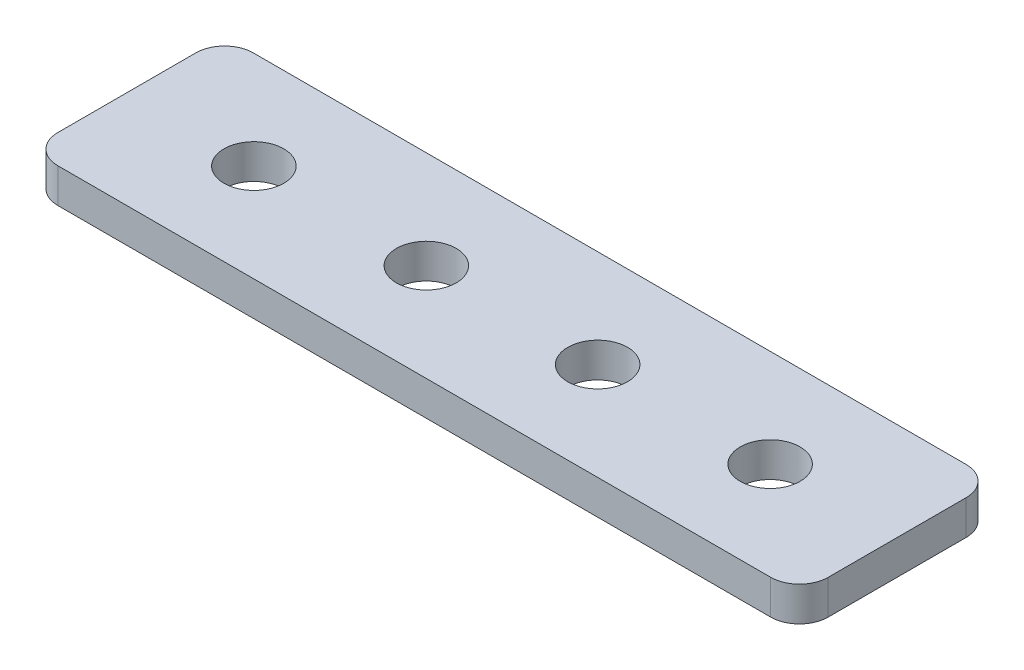
ISO-10303-21;
HEADER;
FILE_DESCRIPTION(('STEP AP214'),'2;1');
FILE_NAME('part.step','',(''),(''),'','','');
FILE_SCHEMA(('AUTOMOTIVE_DESIGN { 1 0 10303 214 1 1 1 1 }'));
ENDSEC;
DATA;
#1=APPLICATION_CONTEXT('core data for automotive mechanical design processes');
#2=APPLICATION_PROTOCOL_DEFINITION('international standard','automotive_design',2000,#1);
#3=PRODUCT_CONTEXT('',#1,'mechanical');
#4=PRODUCT('Part','Part','',(#3));
#5=PRODUCT_RELATED_PRODUCT_CATEGORY('part','',(#4));
#6=PRODUCT_DEFINITION_FORMATION('','',#4);
#7=PRODUCT_DEFINITION_CONTEXT('part definition',#1,'design');
#8=PRODUCT_DEFINITION('design','',#6,#7);
#9=PRODUCT_DEFINITION_SHAPE('','',#8);
#10=(LENGTH_UNIT() NAMED_UNIT(*) SI_UNIT(.MILLI.,.METRE.));
#11=(NAMED_UNIT(*) PLANE_ANGLE_UNIT() SI_UNIT($,.RADIAN.));
#12=(NAMED_UNIT(*) SI_UNIT($,.STERADIAN.) SOLID_ANGLE_UNIT());
#13=UNCERTAINTY_MEASURE_WITH_UNIT(LENGTH_MEASURE(1.E-05),#10,'distance_accuracy_value','');
#14=(GEOMETRIC_REPRESENTATION_CONTEXT(3) GLOBAL_UNCERTAINTY_ASSIGNED_CONTEXT((#13)) GLOBAL_UNIT_ASSIGNED_CONTEXT((#10,
#11,#12)) REPRESENTATION_CONTEXT('',''));
#15=CARTESIAN_POINT('',(0.,0.,0.));
#16=DIRECTION('',(0.,0.,1.));
#17=DIRECTION('',(1.,0.,0.));
#18=AXIS2_PLACEMENT_3D('',#15,#16,#17);
#19=CARTESIAN_POINT('',(31.,2.,6.00000000000003));
#20=DIRECTION('',(0.,1.,0.));
#21=DIRECTION('',(0.,0.,1.));
#22=AXIS2_PLACEMENT_3D('',#19,#20,#21);
#23=CYLINDRICAL_SURFACE('',#22,2.5);
#24=DIRECTION('',(0.,1.,0.));
#25=VECTOR('',#24,1.);
#26=CARTESIAN_POINT('',(31.,2.,8.50000000000003));
#27=LINE('',#26,#25);
#28=CARTESIAN_POINT('',(31.,-1.,8.50000000000003));
#29=VERTEX_POINT('',#28);
#30=CARTESIAN_POINT('',(31.,2.,8.50000000000003));
#31=VERTEX_POINT('',#30);
#32=EDGE_CURVE('E11',#29,#31,#27,.T.);
#33=ORIENTED_EDGE('',*,*,#32,.F.);
#34=CARTESIAN_POINT('',(31.,-1.,6.00000000000003));
#35=DIRECTION('',(0.,1.,0.));
#36=DIRECTION('',(0.,0.,1.));
#37=AXIS2_PLACEMENT_3D('',#34,#35,#36);
#38=CIRCLE('',#37,2.5);
#39=CARTESIAN_POINT('',(33.5,-1.,6.00000000000003));
#40=VERTEX_POINT('',#39);
#41=EDGE_CURVE('E109',#29,#40,#38,.T.);
#42=ORIENTED_EDGE('',*,*,#41,.T.);
#43=DIRECTION('',(0.,1.,0.));
#44=VECTOR('',#43,1.);
#45=CARTESIAN_POINT('',(33.5,2.,6.00000000000003));
#46=LINE('',#45,#44);
#47=CARTESIAN_POINT('',(33.5,2.,6.00000000000003));
#48=VERTEX_POINT('',#47);
#49=EDGE_CURVE('E51',#40,#48,#46,.T.);
#50=ORIENTED_EDGE('',*,*,#49,.T.);
#51=CARTESIAN_POINT('',(31.,2.,6.00000000000003));
#52=DIRECTION('',(0.,1.,0.));
#53=DIRECTION('',(0.,0.,1.));
#54=AXIS2_PLACEMENT_3D('',#51,#52,#53);
#55=CIRCLE('',#54,2.5);
#56=EDGE_CURVE('E168',#31,#48,#55,.T.);
#57=ORIENTED_EDGE('',*,*,#56,.F.);
#58=EDGE_LOOP('',(#33,#42,#50,#57));
#59=FACE_BOUND('',#58,.T.);
#60=ADVANCED_FACE('F40',(#59),#23,.T.);
#61=CARTESIAN_POINT('',(33.5,2.,6.00000000000003));
#62=DIRECTION('',(1.,0.,0.));
#63=DIRECTION('',(0.,0.,-1.));
#64=AXIS2_PLACEMENT_3D('',#61,#62,#63);
#65=PLANE('',#64);
#66=ORIENTED_EDGE('',*,*,#49,.F.);
#67=DIRECTION('',(0.,0.,1.));
#68=VECTOR('',#67,1.);
#69=CARTESIAN_POINT('',(33.5,-1.,6.00000000000003));
#70=LINE('',#69,#68);
#71=CARTESIAN_POINT('',(33.5,-1.,-6.00000000000003));
#72=VERTEX_POINT('',#71);
#73=EDGE_CURVE('E139',#40,#72,#70,.F.);
#74=ORIENTED_EDGE('',*,*,#73,.T.);
#75=DIRECTION('',(0.,1.,0.));
#76=VECTOR('',#75,1.);
#77=CARTESIAN_POINT('',(33.5,2.,-6.00000000000003));
#78=LINE('',#77,#76);
#79=CARTESIAN_POINT('',(33.5,2.,-6.00000000000003));
#80=VERTEX_POINT('',#79);
#81=EDGE_CURVE('E158',#72,#80,#78,.T.);
#82=ORIENTED_EDGE('',*,*,#81,.T.);
#83=DIRECTION('',(0.,0.,-1.));
#84=VECTOR('',#83,1.);
#85=CARTESIAN_POINT('',(33.5,2.,6.00000000000003));
#86=LINE('',#85,#84);
#87=EDGE_CURVE('E177',#48,#80,#86,.T.);
#88=ORIENTED_EDGE('',*,*,#87,.F.);
#89=EDGE_LOOP('',(#66,#74,#82,#88));
#90=FACE_BOUND('',#89,.T.);
#91=ADVANCED_FACE('F181',(#90),#65,.T.);
#92=CARTESIAN_POINT('',(31.,2.,-6.00000000000003));
#93=DIRECTION('',(0.,1.,0.));
#94=DIRECTION('',(0.,0.,1.));
#95=AXIS2_PLACEMENT_3D('',#92,#93,#94);
#96=CYLINDRICAL_SURFACE('',#95,2.5);
#97=ORIENTED_EDGE('',*,*,#81,.F.);
#98=CARTESIAN_POINT('',(31.,-1.,-6.00000000000003));
#99=DIRECTION('',(0.,1.,0.));
#100=DIRECTION('',(0.,0.,1.));
#101=AXIS2_PLACEMENT_3D('',#98,#99,#100);
#102=CIRCLE('',#101,2.5);
#103=CARTESIAN_POINT('',(31.,-1.,-8.50000000000003));
#104=VERTEX_POINT('',#103);
#105=EDGE_CURVE('E135',#72,#104,#102,.T.);
#106=ORIENTED_EDGE('',*,*,#105,.T.);
#107=DIRECTION('',(0.,1.,0.));
#108=VECTOR('',#107,1.);
#109=CARTESIAN_POINT('',(31.,2.,-8.50000000000003));
#110=LINE('',#109,#108);
#111=CARTESIAN_POINT('',(31.,2.,-8.50000000000003));
#112=VERTEX_POINT('',#111);
#113=EDGE_CURVE('E154',#104,#112,#110,.T.);
#114=ORIENTED_EDGE('',*,*,#113,.T.);
#115=CARTESIAN_POINT('',(31.,2.,-6.00000000000003));
#116=DIRECTION('',(0.,1.,0.));
#117=DIRECTION('',(0.,0.,1.));
#118=AXIS2_PLACEMENT_3D('',#115,#116,#117);
#119=CIRCLE('',#118,2.5);
#120=EDGE_CURVE('E183',#80,#112,#119,.T.);
#121=ORIENTED_EDGE('',*,*,#120,.F.);
#122=EDGE_LOOP('',(#97,#106,#114,#121));
#123=FACE_BOUND('',#122,.T.);
#124=ADVANCED_FACE('F235',(#123),#96,.T.);
#125=CARTESIAN_POINT('',(31.,2.,-8.50000000000003));
#126=DIRECTION('',(0.,0.,-1.));
#127=DIRECTION('',(-1.,0.,0.));
#128=AXIS2_PLACEMENT_3D('',#125,#126,#127);
#129=PLANE('',#128);
#130=ORIENTED_EDGE('',*,*,#113,.F.);
#131=DIRECTION('',(1.,0.,0.));
#132=VECTOR('',#131,1.);
#133=CARTESIAN_POINT('',(-31.,-1.,-8.50000000000003));
#134=LINE('',#133,#132);
#135=CARTESIAN_POINT('',(-31.,-1.,-8.50000000000003));
#136=VERTEX_POINT('',#135);
#137=EDGE_CURVE('E131',#104,#136,#134,.F.);
#138=ORIENTED_EDGE('',*,*,#137,.T.);
#139=DIRECTION('',(0.,1.,0.));
#140=VECTOR('',#139,1.);
#141=CARTESIAN_POINT('',(-31.,2.,-8.50000000000003));
#142=LINE('',#141,#140);
#143=CARTESIAN_POINT('',(-31.,2.,-8.50000000000003));
#144=VERTEX_POINT('',#143);
#145=EDGE_CURVE('E150',#136,#144,#142,.T.);
#146=ORIENTED_EDGE('',*,*,#145,.T.);
#147=DIRECTION('',(-1.,0.,0.));
#148=VECTOR('',#147,1.);
#149=CARTESIAN_POINT('',(31.,2.,-8.50000000000003));
#150=LINE('',#149,#148);
#151=EDGE_CURVE('E187',#112,#144,#150,.T.);
#152=ORIENTED_EDGE('',*,*,#151,.F.);
#153=EDGE_LOOP('',(#130,#138,#146,#152));
#154=FACE_BOUND('',#153,.T.);
#155=ADVANCED_FACE('F240',(#154),#129,.T.);
#156=CARTESIAN_POINT('',(-31.,2.,-6.00000000000003));
#157=DIRECTION('',(0.,1.,0.));
#158=DIRECTION('',(0.,0.,1.));
#159=AXIS2_PLACEMENT_3D('',#156,#157,#158);
#160=CYLINDRICAL_SURFACE('',#159,2.5);
#161=ORIENTED_EDGE('',*,*,#145,.F.);
#162=CARTESIAN_POINT('',(-31.,-1.,-6.00000000000003));
#163=DIRECTION('',(0.,1.,0.));
#164=DIRECTION('',(0.,0.,1.));
#165=AXIS2_PLACEMENT_3D('',#162,#163,#164);
#166=CIRCLE('',#165,2.5);
#167=CARTESIAN_POINT('',(-33.5,-1.,-6.00000000000003));
#168=VERTEX_POINT('',#167);
#169=EDGE_CURVE('E127',#136,#168,#166,.T.);
#170=ORIENTED_EDGE('',*,*,#169,.T.);
#171=DIRECTION('',(0.,1.,0.));
#172=VECTOR('',#171,1.);
#173=CARTESIAN_POINT('',(-33.5,2.,-6.00000000000003));
#174=LINE('',#173,#172);
#175=CARTESIAN_POINT('',(-33.5,2.,-6.00000000000003));
#176=VERTEX_POINT('',#175);
#177=EDGE_CURVE('E147',#168,#176,#174,.T.);
#178=ORIENTED_EDGE('',*,*,#177,.T.);
#179=CARTESIAN_POINT('',(-31.,2.,-6.00000000000003));
#180=DIRECTION('',(0.,1.,0.));
#181=DIRECTION('',(0.,0.,1.));
#182=AXIS2_PLACEMENT_3D('',#179,#180,#181);
#183=CIRCLE('',#182,2.5);
#184=EDGE_CURVE('E194',#144,#176,#183,.T.);
#185=ORIENTED_EDGE('',*,*,#184,.F.);
#186=EDGE_LOOP('',(#161,#170,#178,#185));
#187=FACE_BOUND('',#186,.T.);
#188=ADVANCED_FACE('F244',(#187),#160,.T.);
#189=CARTESIAN_POINT('',(-33.5,2.,-6.00000000000003));
#190=DIRECTION('',(-1.,0.,0.));
#191=DIRECTION('',(0.,0.,1.));
#192=AXIS2_PLACEMENT_3D('',#189,#190,#191);
#193=PLANE('',#192);
#194=ORIENTED_EDGE('',*,*,#177,.F.);
#195=DIRECTION('',(0.,0.,1.));
#196=VECTOR('',#195,1.);
#197=CARTESIAN_POINT('',(-33.5,-1.,6.00000000000003));
#198=LINE('',#197,#196);
#199=CARTESIAN_POINT('',(-33.5,-1.,6.00000000000003));
#200=VERTEX_POINT('',#199);
#201=EDGE_CURVE('E123',#168,#200,#198,.T.);
#202=ORIENTED_EDGE('',*,*,#201,.T.);
#203=DIRECTION('',(0.,1.,0.));
#204=VECTOR('',#203,1.);
#205=CARTESIAN_POINT('',(-33.5,2.,6.00000000000003));
#206=LINE('',#205,#204);
#207=CARTESIAN_POINT('',(-33.5,2.,6.00000000000003));
#208=VERTEX_POINT('',#207);
#209=EDGE_CURVE('E59',#200,#208,#206,.T.);
#210=ORIENTED_EDGE('',*,*,#209,.T.);
#211=DIRECTION('',(0.,0.,1.));
#212=VECTOR('',#211,1.);
#213=CARTESIAN_POINT('',(-33.5,2.,-6.00000000000003));
#214=LINE('',#213,#212);
#215=EDGE_CURVE('E102',#176,#208,#214,.T.);
#216=ORIENTED_EDGE('',*,*,#215,.F.);
#217=EDGE_LOOP('',(#194,#202,#210,#216));
#218=FACE_BOUND('',#217,.T.);
#219=ADVANCED_FACE('F248',(#218),#193,.T.);
#220=CARTESIAN_POINT('',(-31.,2.,6.00000000000003));
#221=DIRECTION('',(0.,1.,0.));
#222=DIRECTION('',(0.,0.,1.));
#223=AXIS2_PLACEMENT_3D('',#220,#221,#222);
#224=CYLINDRICAL_SURFACE('',#223,2.5);
#225=ORIENTED_EDGE('',*,*,#209,.F.);
#226=CARTESIAN_POINT('',(-31.,-1.,6.00000000000003));
#227=DIRECTION('',(0.,1.,0.));
#228=DIRECTION('',(0.,0.,1.));
#229=AXIS2_PLACEMENT_3D('',#226,#227,#228);
#230=CIRCLE('',#229,2.5);
#231=CARTESIAN_POINT('',(-31.,-1.,8.50000000000003));
#232=VERTEX_POINT('',#231);
#233=EDGE_CURVE('E107',#200,#232,#230,.T.);
#234=ORIENTED_EDGE('',*,*,#233,.T.);
#235=DIRECTION('',(0.,1.,0.));
#236=VECTOR('',#235,1.);
#237=CARTESIAN_POINT('',(-31.,2.,8.50000000000003));
#238=LINE('',#237,#236);
#239=CARTESIAN_POINT('',(-31.,2.,8.50000000000003));
#240=VERTEX_POINT('',#239);
#241=EDGE_CURVE('E44',#232,#240,#238,.T.);
#242=ORIENTED_EDGE('',*,*,#241,.T.);
#243=CARTESIAN_POINT('',(-31.,2.,6.00000000000003));
#244=DIRECTION('',(0.,1.,0.));
#245=DIRECTION('',(0.,0.,1.));
#246=AXIS2_PLACEMENT_3D('',#243,#244,#245);
#247=CIRCLE('',#246,2.5);
#248=EDGE_CURVE('E284',#208,#240,#247,.T.);
#249=ORIENTED_EDGE('',*,*,#248,.F.);
#250=EDGE_LOOP('',(#225,#234,#242,#249));
#251=FACE_BOUND('',#250,.T.);
#252=ADVANCED_FACE('F112',(#251),#224,.T.);
#253=CARTESIAN_POINT('',(-22.45,2.,0.));
#254=DIRECTION('',(0.,1.,0.));
#255=DIRECTION('',(0.,0.,1.));
#256=AXIS2_PLACEMENT_3D('',#253,#254,#255);
#257=CYLINDRICAL_SURFACE('',#256,2.6);
#258=CARTESIAN_POINT('',(-22.45,2.,0.));
#259=DIRECTION('',(0.,1.,0.));
#260=DIRECTION('',(0.,0.,1.));
#261=AXIS2_PLACEMENT_3D('',#258,#259,#260);
#262=CIRCLE('',#261,2.6);
#263=CARTESIAN_POINT('',(-22.45,2.,2.6));
#264=VERTEX_POINT('',#263);
#265=EDGE_CURVE('E126',#264,#264,#262,.T.);
#266=ORIENTED_EDGE('',*,*,#265,.T.);
#267=EDGE_LOOP('',(#266));
#268=FACE_BOUND('',#267,.T.);
#269=CARTESIAN_POINT('',(-22.45,-1.,0.));
#270=DIRECTION('',(0.,1.,0.));
#271=DIRECTION('',(0.,0.,1.));
#272=AXIS2_PLACEMENT_3D('',#269,#270,#271);
#273=CIRCLE('',#272,2.6);
#274=CARTESIAN_POINT('',(-22.45,-1.,2.6));
#275=VERTEX_POINT('',#274);
#276=EDGE_CURVE('E201',#275,#275,#273,.T.);
#277=ORIENTED_EDGE('',*,*,#276,.F.);
#278=EDGE_LOOP('',(#277));
#279=FACE_BOUND('',#278,.T.);
#280=ADVANCED_FACE('F227',(#268,#279),#257,.F.);
#281=CARTESIAN_POINT('',(7.45,2.,0.));
#282=DIRECTION('',(0.,1.,0.));
#283=DIRECTION('',(0.,0.,1.));
#284=AXIS2_PLACEMENT_3D('',#281,#282,#283);
#285=CYLINDRICAL_SURFACE('',#284,2.6);
#286=CARTESIAN_POINT('',(7.45,2.,0.));
#287=DIRECTION('',(0.,1.,0.));
#288=DIRECTION('',(0.,0.,-1.));
#289=AXIS2_PLACEMENT_3D('',#286,#287,#288);
#290=CIRCLE('',#289,2.6);
#291=CARTESIAN_POINT('',(7.45,2.,-2.6));
#292=VERTEX_POINT('',#291);
#293=EDGE_CURVE('E276',#292,#292,#290,.T.);
#294=ORIENTED_EDGE('',*,*,#293,.T.);
#295=EDGE_LOOP('',(#294));
#296=FACE_BOUND('',#295,.T.);
#297=CARTESIAN_POINT('',(7.45,-1.,0.));
#298=DIRECTION('',(0.,1.,0.));
#299=DIRECTION('',(0.,0.,1.));
#300=AXIS2_PLACEMENT_3D('',#297,#298,#299);
#301=CIRCLE('',#300,2.6);
#302=CARTESIAN_POINT('',(7.45,-1.,2.6));
#303=VERTEX_POINT('',#302);
#304=EDGE_CURVE('E205',#303,#303,#301,.T.);
#305=ORIENTED_EDGE('',*,*,#304,.F.);
#306=EDGE_LOOP('',(#305));
#307=FACE_BOUND('',#306,.T.);
#308=ADVANCED_FACE('F218',(#296,#307),#285,.F.);
#309=CARTESIAN_POINT('',(-7.45,2.,0.));
#310=DIRECTION('',(0.,1.,0.));
#311=DIRECTION('',(0.,0.,1.));
#312=AXIS2_PLACEMENT_3D('',#309,#310,#311);
#313=CYLINDRICAL_SURFACE('',#312,2.6);
#314=CARTESIAN_POINT('',(-7.45,2.,0.));
#315=DIRECTION('',(0.,1.,0.));
#316=DIRECTION('',(0.,0.,1.));
#317=AXIS2_PLACEMENT_3D('',#314,#315,#316);
#318=CIRCLE('',#317,2.6);
#319=CARTESIAN_POINT('',(-7.45,2.,2.6));
#320=VERTEX_POINT('',#319);
#321=EDGE_CURVE('E279',#320,#320,#318,.T.);
#322=ORIENTED_EDGE('',*,*,#321,.T.);
#323=EDGE_LOOP('',(#322));
#324=FACE_BOUND('',#323,.T.);
#325=CARTESIAN_POINT('',(-7.45,-1.,0.));
#326=DIRECTION('',(0.,1.,0.));
#327=DIRECTION('',(0.,0.,1.));
#328=AXIS2_PLACEMENT_3D('',#325,#326,#327);
#329=CIRCLE('',#328,2.6);
#330=CARTESIAN_POINT('',(-7.45,-1.,2.6));
#331=VERTEX_POINT('',#330);
#332=EDGE_CURVE('E119',#331,#331,#329,.T.);
#333=ORIENTED_EDGE('',*,*,#332,.F.);
#334=EDGE_LOOP('',(#333));
#335=FACE_BOUND('',#334,.T.);
#336=ADVANCED_FACE('F215',(#324,#335),#313,.F.);
#337=CARTESIAN_POINT('',(22.45,2.,0.));
#338=DIRECTION('',(0.,1.,0.));
#339=DIRECTION('',(0.,0.,1.));
#340=AXIS2_PLACEMENT_3D('',#337,#338,#339);
#341=CYLINDRICAL_SURFACE('',#340,2.6);
#342=CARTESIAN_POINT('',(22.45,2.,0.));
#343=DIRECTION('',(0.,1.,0.));
#344=DIRECTION('',(0.,0.,-1.));
#345=AXIS2_PLACEMENT_3D('',#342,#343,#344);
#346=CIRCLE('',#345,2.6);
#347=CARTESIAN_POINT('',(22.45,2.,-2.6));
#348=VERTEX_POINT('',#347);
#349=EDGE_CURVE('E282',#348,#348,#346,.T.);
#350=ORIENTED_EDGE('',*,*,#349,.T.);
#351=EDGE_LOOP('',(#350));
#352=FACE_BOUND('',#351,.T.);
#353=CARTESIAN_POINT('',(22.45,-1.,0.));
#354=DIRECTION('',(0.,1.,0.));
#355=DIRECTION('',(0.,0.,1.));
#356=AXIS2_PLACEMENT_3D('',#353,#354,#355);
#357=CIRCLE('',#356,2.6);
#358=CARTESIAN_POINT('',(22.45,-1.,2.6));
#359=VERTEX_POINT('',#358);
#360=EDGE_CURVE('E114',#359,#359,#357,.T.);
#361=ORIENTED_EDGE('',*,*,#360,.F.);
#362=EDGE_LOOP('',(#361));
#363=FACE_BOUND('',#362,.T.);
#364=ADVANCED_FACE('F217',(#352,#363),#341,.F.);
#365=CARTESIAN_POINT('',(-31.,2.,8.50000000000003));
#366=DIRECTION('',(0.,0.,1.));
#367=DIRECTION('',(1.,0.,0.));
#368=AXIS2_PLACEMENT_3D('',#365,#366,#367);
#369=PLANE('',#368);
#370=DIRECTION('',(1.,0.,0.));
#371=VECTOR('',#370,1.);
#372=CARTESIAN_POINT('',(-31.,-1.,8.50000000000003));
#373=LINE('',#372,#371);
#374=EDGE_CURVE('E95',#232,#29,#373,.T.);
#375=ORIENTED_EDGE('',*,*,#374,.T.);
#376=ORIENTED_EDGE('',*,*,#32,.T.);
#377=DIRECTION('',(1.,0.,0.));
#378=VECTOR('',#377,1.);
#379=CARTESIAN_POINT('',(-31.,2.,8.50000000000003));
#380=LINE('',#379,#378);
#381=EDGE_CURVE('E97',#240,#31,#380,.T.);
#382=ORIENTED_EDGE('',*,*,#381,.F.);
#383=ORIENTED_EDGE('',*,*,#241,.F.);
#384=EDGE_LOOP('',(#375,#376,#382,#383));
#385=FACE_BOUND('',#384,.T.);
#386=ADVANCED_FACE('F42',(#385),#369,.T.);
#387=CARTESIAN_POINT('',(-31.,2.,6.00000000000003));
#388=DIRECTION('',(0.,1.,0.));
#389=DIRECTION('',(0.,0.,1.));
#390=AXIS2_PLACEMENT_3D('',#387,#388,#389);
#391=PLANE('',#390);
#392=ORIENTED_EDGE('',*,*,#265,.F.);
#393=EDGE_LOOP('',(#392));
#394=FACE_BOUND('',#393,.T.);
#395=ORIENTED_EDGE('',*,*,#293,.F.);
#396=EDGE_LOOP('',(#395));
#397=FACE_BOUND('',#396,.T.);
#398=ORIENTED_EDGE('',*,*,#321,.F.);
#399=EDGE_LOOP('',(#398));
#400=FACE_BOUND('',#399,.T.);
#401=ORIENTED_EDGE('',*,*,#349,.F.);
#402=EDGE_LOOP('',(#401));
#403=FACE_BOUND('',#402,.T.);
#404=ORIENTED_EDGE('',*,*,#248,.T.);
#405=ORIENTED_EDGE('',*,*,#381,.T.);
#406=ORIENTED_EDGE('',*,*,#56,.T.);
#407=ORIENTED_EDGE('',*,*,#87,.T.);
#408=ORIENTED_EDGE('',*,*,#120,.T.);
#409=ORIENTED_EDGE('',*,*,#151,.T.);
#410=ORIENTED_EDGE('',*,*,#184,.T.);
#411=ORIENTED_EDGE('',*,*,#215,.T.);
#412=EDGE_LOOP('',(#404,#405,#406,#407,#408,#409,#410,#411));
#413=FACE_BOUND('',#412,.T.);
#414=ADVANCED_FACE('F175',(#394,#397,#400,#403,#413),#391,.T.);
#415=CARTESIAN_POINT('',(-31.,-1.,6.00000000000003));
#416=DIRECTION('',(0.,1.,0.));
#417=DIRECTION('',(0.,0.,1.));
#418=AXIS2_PLACEMENT_3D('',#415,#416,#417);
#419=PLANE('',#418);
#420=ORIENTED_EDGE('',*,*,#276,.T.);
#421=EDGE_LOOP('',(#420));
#422=FACE_BOUND('',#421,.T.);
#423=ORIENTED_EDGE('',*,*,#304,.T.);
#424=EDGE_LOOP('',(#423));
#425=FACE_BOUND('',#424,.T.);
#426=ORIENTED_EDGE('',*,*,#332,.T.);
#427=EDGE_LOOP('',(#426));
#428=FACE_BOUND('',#427,.T.);
#429=ORIENTED_EDGE('',*,*,#360,.T.);
#430=EDGE_LOOP('',(#429));
#431=FACE_BOUND('',#430,.T.);
#432=ORIENTED_EDGE('',*,*,#233,.F.);
#433=ORIENTED_EDGE('',*,*,#201,.F.);
#434=ORIENTED_EDGE('',*,*,#169,.F.);
#435=ORIENTED_EDGE('',*,*,#137,.F.);
#436=ORIENTED_EDGE('',*,*,#105,.F.);
#437=ORIENTED_EDGE('',*,*,#73,.F.);
#438=ORIENTED_EDGE('',*,*,#41,.F.);
#439=ORIENTED_EDGE('',*,*,#374,.F.);
#440=EDGE_LOOP('',(#432,#433,#434,#435,#436,#437,#438,#439));
#441=FACE_BOUND('',#440,.T.);
#442=ADVANCED_FACE('F105',(#422,#425,#428,#431,#441),#419,.F.);
#443=CLOSED_SHELL('',(#60,#91,#124,#155,#188,#219,#252,#280,#308,#336,#364,#386,#414,#442));
#444=MANIFOLD_SOLID_BREP('B2',#443);
#445=ADVANCED_BREP_SHAPE_REPRESENTATION('',(#18,#444),#14);
#446=SHAPE_DEFINITION_REPRESENTATION(#9,#445);
ENDSEC;
END-ISO-10303-21;
